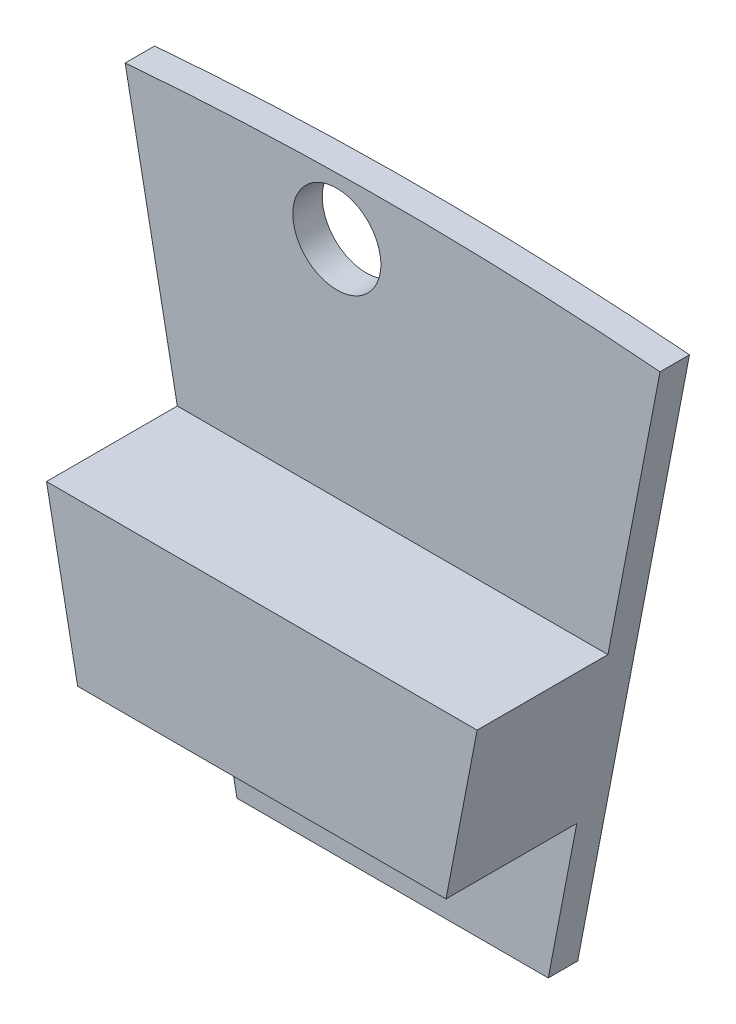
ISO-10303-21;
HEADER;
FILE_DESCRIPTION(('STEP AP214'),'2;1');
FILE_NAME('part.step','',(''),(''),'','','');
FILE_SCHEMA(('AUTOMOTIVE_DESIGN { 1 0 10303 214 1 1 1 1 }'));
ENDSEC;
DATA;
#1=APPLICATION_CONTEXT('core data for automotive mechanical design processes');
#2=APPLICATION_PROTOCOL_DEFINITION('international standard','automotive_design',2000,#1);
#3=PRODUCT_CONTEXT('',#1,'mechanical');
#4=PRODUCT('Part','Part','',(#3));
#5=PRODUCT_RELATED_PRODUCT_CATEGORY('part','',(#4));
#6=PRODUCT_DEFINITION_FORMATION('','',#4);
#7=PRODUCT_DEFINITION_CONTEXT('part definition',#1,'design');
#8=PRODUCT_DEFINITION('design','',#6,#7);
#9=PRODUCT_DEFINITION_SHAPE('','',#8);
#10=(LENGTH_UNIT() NAMED_UNIT(*) SI_UNIT(.MILLI.,.METRE.));
#11=(NAMED_UNIT(*) PLANE_ANGLE_UNIT() SI_UNIT($,.RADIAN.));
#12=(NAMED_UNIT(*) SI_UNIT($,.STERADIAN.) SOLID_ANGLE_UNIT());
#13=UNCERTAINTY_MEASURE_WITH_UNIT(LENGTH_MEASURE(1.E-05),#10,'distance_accuracy_value','');
#14=(GEOMETRIC_REPRESENTATION_CONTEXT(3) GLOBAL_UNCERTAINTY_ASSIGNED_CONTEXT((#13)) GLOBAL_UNIT_ASSIGNED_CONTEXT((#10,
#11,#12)) REPRESENTATION_CONTEXT('',''));
#15=CARTESIAN_POINT('',(0.,0.,0.));
#16=DIRECTION('',(0.,0.,1.));
#17=DIRECTION('',(1.,0.,0.));
#18=AXIS2_PLACEMENT_3D('',#15,#16,#17);
#19=CARTESIAN_POINT('',(-6.58395838801708,90.8766231600002,0.));
#20=DIRECTION('',(0.,0.,-0.999999999999994));
#21=DIRECTION('',(-1.,0.,0.));
#22=AXIS2_PLACEMENT_3D('',#19,#20,#21);
#23=PLANE('',#22);
#24=CARTESIAN_POINT('',(-1.70597272924437,97.7351122015374,0.));
#25=DIRECTION('',(0.,0.,0.999999999999994));
#26=DIRECTION('',(1.,0.,0.));
#27=AXIS2_PLACEMENT_3D('',#24,#25,#26);
#28=CIRCLE('',#27,1.34620000000001);
#29=CARTESIAN_POINT('',(-0.359772729244356,97.7351122015374,0.));
#30=VERTEX_POINT('',#29);
#31=EDGE_CURVE('E127',#30,#30,#28,.T.);
#32=ORIENTED_EDGE('',*,*,#31,.T.);
#33=EDGE_LOOP('',(#32));
#34=FACE_BOUND('',#33,.T.);
#35=DIRECTION('',(0.188943637083483,0.981987933737309,0.));
#36=VECTOR('',#35,1.);
#37=CARTESIAN_POINT('',(5.63213312557401,85.9297462120742,0.));
#38=LINE('',#37,#36);
#39=CARTESIAN_POINT('',(4.76056770713033,81.4,0.));
#40=VERTEX_POINT('',#39);
#41=CARTESIAN_POINT('',(8.17839595884315,99.1633190224108,0.));
#42=VERTEX_POINT('',#41);
#43=EDGE_CURVE('E192',#40,#42,#38,.T.);
#44=ORIENTED_EDGE('',*,*,#43,.F.);
#45=DIRECTION('',(-1.,0.,0.));
#46=VECTOR('',#45,1.);
#47=CARTESIAN_POINT('',(-4.76056770713023,81.4000000000001,0.));
#48=LINE('',#47,#46);
#49=CARTESIAN_POINT('',(-4.76056770713023,81.4000000000001,0.));
#50=VERTEX_POINT('',#49);
#51=EDGE_CURVE('E156',#40,#50,#48,.T.);
#52=ORIENTED_EDGE('',*,*,#51,.T.);
#53=DIRECTION('',(0.188943637083481,-0.981987933737309,0.));
#54=VECTOR('',#53,1.);
#55=CARTESIAN_POINT('',(-5.6321331255739,85.9297462120742,0.));
#56=LINE('',#55,#54);
#57=CARTESIAN_POINT('',(-8.17839595884303,99.1633190224107,0.));
#58=VERTEX_POINT('',#57);
#59=EDGE_CURVE('E185',#58,#50,#56,.T.);
#60=ORIENTED_EDGE('',*,*,#59,.F.);
#61=CARTESIAN_POINT('',(0.,0.,0.));
#62=DIRECTION('',(0.,0.,-0.999999999999994));
#63=DIRECTION('',(1.,0.,0.));
#64=AXIS2_PLACEMENT_3D('',#61,#62,#63);
#65=CIRCLE('',#64,99.5);
#66=EDGE_CURVE('E168',#58,#42,#65,.T.);
#67=ORIENTED_EDGE('',*,*,#66,.T.);
#68=EDGE_LOOP('',(#44,#52,#60,#67));
#69=FACE_BOUND('',#68,.T.);
#70=DIRECTION('',(-0.0174524064372812,0.999847695156393,0.));
#71=VECTOR('',#70,1.);
#72=CARTESIAN_POINT('',(-1.06918891596203,83.9942089693636,0.));
#73=LINE('',#72,#71);
#74=CARTESIAN_POINT('',(-1.05173385103382,82.9942089693636,0.));
#75=VERTEX_POINT('',#74);
#76=CARTESIAN_POINT('',(-1.06918891596203,83.9942089693636,0.));
#77=VERTEX_POINT('',#76);
#78=EDGE_CURVE('E140',#75,#77,#73,.T.);
#79=ORIENTED_EDGE('',*,*,#78,.T.);
#80=CARTESIAN_POINT('',(-1.46600346997723,83.9872825455589,0.));
#81=DIRECTION('',(0.,0.,0.999999999999994));
#82=DIRECTION('',(1.,0.,0.));
#83=AXIS2_PLACEMENT_3D('',#80,#81,#82);
#84=CIRCLE('',#83,0.396875);
#85=CARTESIAN_POINT('',(-1.86281802399245,83.9803561217539,0.));
#86=VERTEX_POINT('',#85);
#87=EDGE_CURVE('E49',#77,#86,#84,.T.);
#88=ORIENTED_EDGE('',*,*,#87,.T.);
#89=DIRECTION('',(0.0174524064372831,-0.999847695156393,0.));
#90=VECTOR('',#89,1.);
#91=CARTESIAN_POINT('',(-1.86281802399245,83.9803561217539,0.));
#92=LINE('',#91,#90);
#93=CARTESIAN_POINT('',(-1.84536295906416,82.980356121754,0.));
#94=VERTEX_POINT('',#93);
#95=EDGE_CURVE('E131',#86,#94,#92,.T.);
#96=ORIENTED_EDGE('',*,*,#95,.T.);
#97=CARTESIAN_POINT('',(-1.44854840504902,82.9872825455587,0.));
#98=DIRECTION('',(0.,0.,0.999999999999994));
#99=DIRECTION('',(-1.,0.,0.));
#100=AXIS2_PLACEMENT_3D('',#97,#98,#99);
#101=CIRCLE('',#100,0.396875);
#102=EDGE_CURVE('E137',#94,#75,#101,.T.);
#103=ORIENTED_EDGE('',*,*,#102,.T.);
#104=EDGE_LOOP('',(#79,#88,#96,#103));
#105=FACE_BOUND('',#104,.T.);
#106=ADVANCED_FACE('F34',(#34,#69,#105),#23,.T.);
#107=CARTESIAN_POINT('',(0.,0.,0.899999999999994));
#108=DIRECTION('',(0.,0.,-0.999999999999994));
#109=DIRECTION('',(-1.,0.,0.));
#110=AXIS2_PLACEMENT_3D('',#107,#108,#109);
#111=PLANE('',#110);
#112=DIRECTION('',(-0.188943637083483,-0.981987933737308,0.));
#113=VECTOR('',#112,1.);
#114=CARTESIAN_POINT('',(4.76056770713033,81.4,0.899999999999983));
#115=LINE('',#114,#113);
#116=CARTESIAN_POINT('',(5.63213312557401,85.9297462120742,0.900000000000001));
#117=VERTEX_POINT('',#116);
#118=CARTESIAN_POINT('',(4.76056770713033,81.4,0.899999999999983));
#119=VERTEX_POINT('',#118);
#120=EDGE_CURVE('E152',#117,#119,#115,.T.);
#121=ORIENTED_EDGE('',*,*,#120,.F.);
#122=DIRECTION('',(-1.,0.,0.));
#123=VECTOR('',#122,1.);
#124=CARTESIAN_POINT('',(-5.6321331255739,85.9297462120742,0.899999999999991));
#125=LINE('',#124,#123);
#126=CARTESIAN_POINT('',(-5.6321331255739,85.9297462120742,0.899999999999991));
#127=VERTEX_POINT('',#126);
#128=EDGE_CURVE('E214',#117,#127,#125,.T.);
#129=ORIENTED_EDGE('',*,*,#128,.T.);
#130=DIRECTION('',(-0.18894363708348,0.981987933737309,0.));
#131=VECTOR('',#130,1.);
#132=CARTESIAN_POINT('',(-5.6321331255739,85.9297462120742,0.899999999999991));
#133=LINE('',#132,#131);
#134=CARTESIAN_POINT('',(-4.76056770713023,81.4000000000001,0.899999999999991));
#135=VERTEX_POINT('',#134);
#136=EDGE_CURVE('E159',#135,#127,#133,.T.);
#137=ORIENTED_EDGE('',*,*,#136,.F.);
#138=DIRECTION('',(-1.,0.,0.));
#139=VECTOR('',#138,1.);
#140=CARTESIAN_POINT('',(-4.76056770713023,81.4000000000001,0.899999999999991));
#141=LINE('',#140,#139);
#142=EDGE_CURVE('E155',#119,#135,#141,.T.);
#143=ORIENTED_EDGE('',*,*,#142,.F.);
#144=EDGE_LOOP('',(#121,#129,#137,#143));
#145=FACE_BOUND('',#144,.T.);
#146=CARTESIAN_POINT('',(-1.46600346997723,83.9872825455589,0.899999999999991));
#147=DIRECTION('',(0.,0.,-0.999999999999994));
#148=DIRECTION('',(-1.,0.,0.));
#149=AXIS2_PLACEMENT_3D('',#146,#147,#148);
#150=CIRCLE('',#149,0.396875);
#151=CARTESIAN_POINT('',(-1.06918891596203,83.9942089693636,0.899999999999998));
#152=VERTEX_POINT('',#151);
#153=CARTESIAN_POINT('',(-1.86281802399245,83.9803561217539,0.89999999999999));
#154=VERTEX_POINT('',#153);
#155=EDGE_CURVE('E11',#152,#154,#150,.F.);
#156=ORIENTED_EDGE('',*,*,#155,.F.);
#157=DIRECTION('',(-0.0174524064372815,0.999847695156393,0.));
#158=VECTOR('',#157,1.);
#159=CARTESIAN_POINT('',(0.39681455401509,0.00692642380479496,0.899999999999994));
#160=LINE('',#159,#158);
#161=CARTESIAN_POINT('',(-1.05173385103378,82.9942089693636,0.899999999999991));
#162=VERTEX_POINT('',#161);
#163=EDGE_CURVE('E216',#162,#152,#160,.T.);
#164=ORIENTED_EDGE('',*,*,#163,.F.);
#165=CARTESIAN_POINT('',(-1.44854840504902,82.9872825455587,0.899999999999991));
#166=DIRECTION('',(0.,0.,-0.999999999999994));
#167=DIRECTION('',(-1.,0.,0.));
#168=AXIS2_PLACEMENT_3D('',#165,#166,#167);
#169=CIRCLE('',#168,0.396875);
#170=CARTESIAN_POINT('',(-1.84536295906416,82.980356121754,0.899999999999991));
#171=VERTEX_POINT('',#170);
#172=EDGE_CURVE('E220',#171,#162,#169,.F.);
#173=ORIENTED_EDGE('',*,*,#172,.F.);
#174=DIRECTION('',(0.0174524064372831,-0.999847695156393,0.));
#175=VECTOR('',#174,1.);
#176=CARTESIAN_POINT('',(-0.396814554015166,-0.00692642380479685,0.899999999999994));
#177=LINE('',#176,#175);
#178=EDGE_CURVE('E42',#154,#171,#177,.T.);
#179=ORIENTED_EDGE('',*,*,#178,.F.);
#180=EDGE_LOOP('',(#156,#164,#173,#179));
#181=FACE_BOUND('',#180,.T.);
#182=ADVANCED_FACE('F226',(#145,#181),#111,.F.);
#183=CARTESIAN_POINT('',(0.,0.,0.899999999999994));
#184=DIRECTION('',(0.,0.,-0.999999999999994));
#185=DIRECTION('',(-1.,0.,0.));
#186=AXIS2_PLACEMENT_3D('',#183,#184,#185);
#187=PLANE('',#186);
#188=DIRECTION('',(-0.188943637083481,0.981987933737309,0.));
#189=VECTOR('',#188,1.);
#190=CARTESIAN_POINT('',(-8.17839595884303,99.1633190224107,0.899999999999994));
#191=LINE('',#190,#189);
#192=CARTESIAN_POINT('',(-6.58395838801708,90.8766231600002,0.899999999999998));
#193=VERTEX_POINT('',#192);
#194=CARTESIAN_POINT('',(-8.17839595884303,99.1633190224107,0.899999999999994));
#195=VERTEX_POINT('',#194);
#196=EDGE_CURVE('E171',#193,#195,#191,.T.);
#197=ORIENTED_EDGE('',*,*,#196,.F.);
#198=DIRECTION('',(1.,0.,0.));
#199=VECTOR('',#198,1.);
#200=CARTESIAN_POINT('',(-6.58395838801708,90.8766231600002,0.899999999999998));
#201=LINE('',#200,#199);
#202=CARTESIAN_POINT('',(6.5839583880172,90.8766231600001,0.900000000000001));
#203=VERTEX_POINT('',#202);
#204=EDGE_CURVE('E211',#193,#203,#201,.T.);
#205=ORIENTED_EDGE('',*,*,#204,.T.);
#206=DIRECTION('',(-0.188943637083483,-0.981987933737308,0.));
#207=VECTOR('',#206,1.);
#208=CARTESIAN_POINT('',(8.17839595884315,99.1633190224108,0.900000000000007));
#209=LINE('',#208,#207);
#210=CARTESIAN_POINT('',(8.17839595884315,99.1633190224108,0.900000000000007));
#211=VERTEX_POINT('',#210);
#212=EDGE_CURVE('E176',#211,#203,#209,.T.);
#213=ORIENTED_EDGE('',*,*,#212,.F.);
#214=CARTESIAN_POINT('',(0.,0.,0.899999999999994));
#215=DIRECTION('',(0.,0.,-0.999999999999994));
#216=DIRECTION('',(1.,0.,0.));
#217=AXIS2_PLACEMENT_3D('',#214,#215,#216);
#218=CIRCLE('',#217,99.5);
#219=EDGE_CURVE('E173',#195,#211,#218,.T.);
#220=ORIENTED_EDGE('',*,*,#219,.F.);
#221=EDGE_LOOP('',(#197,#205,#213,#220));
#222=FACE_BOUND('',#221,.T.);
#223=CARTESIAN_POINT('',(-1.70597272924437,97.7351122015374,0.900000000000001));
#224=DIRECTION('',(0.,0.,-0.999999999999994));
#225=DIRECTION('',(-1.,0.,0.));
#226=AXIS2_PLACEMENT_3D('',#223,#224,#225);
#227=CIRCLE('',#226,1.34620000000001);
#228=CARTESIAN_POINT('',(-3.05217272924438,97.7351122015374,0.900000000000001));
#229=VERTEX_POINT('',#228);
#230=EDGE_CURVE('E151',#229,#229,#227,.F.);
#231=ORIENTED_EDGE('',*,*,#230,.F.);
#232=EDGE_LOOP('',(#231));
#233=FACE_BOUND('',#232,.T.);
#234=ADVANCED_FACE('F240',(#222,#233),#187,.F.);
#235=CARTESIAN_POINT('',(-5.6321331255739,85.9297462120742,4.89999999999995));
#236=DIRECTION('',(0.,1.,0.));
#237=DIRECTION('',(0.,0.,0.999999999999994));
#238=AXIS2_PLACEMENT_3D('',#235,#236,#237);
#239=PLANE('',#238);
#240=ORIENTED_EDGE('',*,*,#128,.F.);
#241=DIRECTION('',(0.,0.,-0.999999999999994));
#242=VECTOR('',#241,1.);
#243=CARTESIAN_POINT('',(5.63213312557401,85.9297462120742,4.89999999999998));
#244=LINE('',#243,#242);
#245=CARTESIAN_POINT('',(5.63213312557401,85.9297462120742,4.89999999999998));
#246=VERTEX_POINT('',#245);
#247=EDGE_CURVE('E205',#246,#117,#244,.T.);
#248=ORIENTED_EDGE('',*,*,#247,.F.);
#249=DIRECTION('',(1.,0.,0.));
#250=VECTOR('',#249,1.);
#251=CARTESIAN_POINT('',(-5.6321331255739,85.9297462120742,4.89999999999995));
#252=LINE('',#251,#250);
#253=CARTESIAN_POINT('',(-5.6321331255739,85.9297462120742,4.89999999999995));
#254=VERTEX_POINT('',#253);
#255=EDGE_CURVE('E191',#254,#246,#252,.T.);
#256=ORIENTED_EDGE('',*,*,#255,.F.);
#257=DIRECTION('',(0.,0.,-0.999999999999994));
#258=VECTOR('',#257,1.);
#259=CARTESIAN_POINT('',(-5.6321331255739,85.9297462120742,4.89999999999995));
#260=LINE('',#259,#258);
#261=EDGE_CURVE('E208',#254,#127,#260,.T.);
#262=ORIENTED_EDGE('',*,*,#261,.T.);
#263=EDGE_LOOP('',(#240,#248,#256,#262));
#264=FACE_BOUND('',#263,.T.);
#265=ADVANCED_FACE('F251',(#264),#239,.F.);
#266=CARTESIAN_POINT('',(-6.58395838801708,90.8766231600002,4.89999999999996));
#267=DIRECTION('',(0.,-1.,0.));
#268=DIRECTION('',(0.,0.,-0.999999999999994));
#269=AXIS2_PLACEMENT_3D('',#266,#267,#268);
#270=PLANE('',#269);
#271=ORIENTED_EDGE('',*,*,#204,.F.);
#272=DIRECTION('',(0.,0.,-0.999999999999994));
#273=VECTOR('',#272,1.);
#274=CARTESIAN_POINT('',(-6.58395838801708,90.8766231600002,4.89999999999996));
#275=LINE('',#274,#273);
#276=CARTESIAN_POINT('',(-6.58395838801708,90.8766231600002,4.89999999999996));
#277=VERTEX_POINT('',#276);
#278=EDGE_CURVE('E198',#277,#193,#275,.T.);
#279=ORIENTED_EDGE('',*,*,#278,.F.);
#280=DIRECTION('',(-1.,0.,0.));
#281=VECTOR('',#280,1.);
#282=CARTESIAN_POINT('',(-6.58395838801708,90.8766231600002,4.89999999999996));
#283=LINE('',#282,#281);
#284=CARTESIAN_POINT('',(6.5839583880172,90.8766231600001,4.89999999999996));
#285=VERTEX_POINT('',#284);
#286=EDGE_CURVE('E196',#285,#277,#283,.T.);
#287=ORIENTED_EDGE('',*,*,#286,.F.);
#288=DIRECTION('',(0.,0.,-0.999999999999994));
#289=VECTOR('',#288,1.);
#290=CARTESIAN_POINT('',(6.5839583880172,90.8766231600001,4.89999999999996));
#291=LINE('',#290,#289);
#292=EDGE_CURVE('E203',#285,#203,#291,.T.);
#293=ORIENTED_EDGE('',*,*,#292,.T.);
#294=EDGE_LOOP('',(#271,#279,#287,#293));
#295=FACE_BOUND('',#294,.T.);
#296=ADVANCED_FACE('F248',(#295),#270,.F.);
#297=CARTESIAN_POINT('',(-5.6321331255739,85.9297462120742,4.89999999999995));
#298=DIRECTION('',(0.981987933737309,0.188943637083483,0.));
#299=DIRECTION('',(-0.188943637083482,0.981987933737308,0.));
#300=AXIS2_PLACEMENT_3D('',#297,#298,#299);
#301=PLANE('',#300);
#302=ORIENTED_EDGE('',*,*,#59,.T.);
#303=DIRECTION('',(0.,0.,-0.999999999999994));
#304=VECTOR('',#303,1.);
#305=CARTESIAN_POINT('',(-4.76056770713023,81.4000000000001,0.899999999999991));
#306=LINE('',#305,#304);
#307=EDGE_CURVE('E165',#135,#50,#306,.T.);
#308=ORIENTED_EDGE('',*,*,#307,.F.);
#309=ORIENTED_EDGE('',*,*,#136,.T.);
#310=ORIENTED_EDGE('',*,*,#261,.F.);
#311=DIRECTION('',(0.188943637083481,-0.981987933737309,0.));
#312=VECTOR('',#311,1.);
#313=CARTESIAN_POINT('',(-5.6321331255739,85.9297462120742,4.89999999999995));
#314=LINE('',#313,#312);
#315=EDGE_CURVE('E188',#277,#254,#314,.T.);
#316=ORIENTED_EDGE('',*,*,#315,.F.);
#317=ORIENTED_EDGE('',*,*,#278,.T.);
#318=ORIENTED_EDGE('',*,*,#196,.T.);
#319=DIRECTION('',(0.,0.,-0.999999999999994));
#320=VECTOR('',#319,1.);
#321=CARTESIAN_POINT('',(-8.17839595884303,99.1633190224107,0.899999999999994));
#322=LINE('',#321,#320);
#323=EDGE_CURVE('E179',#195,#58,#322,.T.);
#324=ORIENTED_EDGE('',*,*,#323,.T.);
#325=EDGE_LOOP('',(#302,#308,#309,#310,#316,#317,#318,#324));
#326=FACE_BOUND('',#325,.T.);
#327=ADVANCED_FACE('F36',(#326),#301,.F.);
#328=CARTESIAN_POINT('',(5.63213312557401,85.9297462120742,4.89999999999998));
#329=DIRECTION('',(-0.981987933737309,0.188943637083481,0.));
#330=DIRECTION('',(-0.188943637083483,-0.981987933737308,0.));
#331=AXIS2_PLACEMENT_3D('',#328,#329,#330);
#332=PLANE('',#331);
#333=ORIENTED_EDGE('',*,*,#43,.T.);
#334=DIRECTION('',(0.,0.,-0.999999999999994));
#335=VECTOR('',#334,1.);
#336=CARTESIAN_POINT('',(8.17839595884315,99.1633190224108,0.900000000000007));
#337=LINE('',#336,#335);
#338=EDGE_CURVE('E182',#211,#42,#337,.T.);
#339=ORIENTED_EDGE('',*,*,#338,.F.);
#340=ORIENTED_EDGE('',*,*,#212,.T.);
#341=ORIENTED_EDGE('',*,*,#292,.F.);
#342=DIRECTION('',(0.188943637083483,0.981987933737309,0.));
#343=VECTOR('',#342,1.);
#344=CARTESIAN_POINT('',(5.63213312557401,85.9297462120742,4.89999999999998));
#345=LINE('',#344,#343);
#346=EDGE_CURVE('E194',#246,#285,#345,.T.);
#347=ORIENTED_EDGE('',*,*,#346,.F.);
#348=ORIENTED_EDGE('',*,*,#247,.T.);
#349=ORIENTED_EDGE('',*,*,#120,.T.);
#350=DIRECTION('',(0.,0.,-0.999999999999994));
#351=VECTOR('',#350,1.);
#352=CARTESIAN_POINT('',(4.76056770713033,81.4,0.899999999999983));
#353=LINE('',#352,#351);
#354=EDGE_CURVE('E162',#119,#40,#353,.T.);
#355=ORIENTED_EDGE('',*,*,#354,.T.);
#356=EDGE_LOOP('',(#333,#339,#340,#341,#347,#348,#349,#355));
#357=FACE_BOUND('',#356,.T.);
#358=ADVANCED_FACE('F253',(#357),#332,.F.);
#359=CARTESIAN_POINT('',(-6.58395838801708,90.8766231600002,4.89999999999996));
#360=DIRECTION('',(0.,0.,-0.999999999999994));
#361=DIRECTION('',(-1.,0.,0.));
#362=AXIS2_PLACEMENT_3D('',#359,#360,#361);
#363=PLANE('',#362);
#364=ORIENTED_EDGE('',*,*,#315,.T.);
#365=ORIENTED_EDGE('',*,*,#255,.T.);
#366=ORIENTED_EDGE('',*,*,#346,.T.);
#367=ORIENTED_EDGE('',*,*,#286,.T.);
#368=EDGE_LOOP('',(#364,#365,#366,#367));
#369=FACE_BOUND('',#368,.T.);
#370=ADVANCED_FACE('F246',(#369),#363,.F.);
#371=CARTESIAN_POINT('',(0.,0.,0.899999999999994));
#372=DIRECTION('',(0.,0.,-0.999999999999994));
#373=DIRECTION('',(-1.,0.,0.));
#374=AXIS2_PLACEMENT_3D('',#371,#372,#373);
#375=CYLINDRICAL_SURFACE('',#374,99.5);
#376=ORIENTED_EDGE('',*,*,#66,.F.);
#377=ORIENTED_EDGE('',*,*,#323,.F.);
#378=ORIENTED_EDGE('',*,*,#219,.T.);
#379=ORIENTED_EDGE('',*,*,#338,.T.);
#380=EDGE_LOOP('',(#376,#377,#378,#379));
#381=FACE_BOUND('',#380,.T.);
#382=ADVANCED_FACE('F280',(#381),#375,.T.);
#383=CARTESIAN_POINT('',(-4.76056770713023,81.4000000000001,0.899999999999991));
#384=DIRECTION('',(0.,-1.,0.));
#385=DIRECTION('',(0.,0.,-0.999999999999994));
#386=AXIS2_PLACEMENT_3D('',#383,#384,#385);
#387=PLANE('',#386);
#388=ORIENTED_EDGE('',*,*,#51,.F.);
#389=ORIENTED_EDGE('',*,*,#354,.F.);
#390=ORIENTED_EDGE('',*,*,#142,.T.);
#391=ORIENTED_EDGE('',*,*,#307,.T.);
#392=EDGE_LOOP('',(#388,#389,#390,#391));
#393=FACE_BOUND('',#392,.T.);
#394=ADVANCED_FACE('F277',(#393),#387,.T.);
#395=CARTESIAN_POINT('',(-1.70597272924437,97.7351122015374,4.89999999999996));
#396=DIRECTION('',(0.,0.,-0.999999999999994));
#397=DIRECTION('',(-1.,0.,0.));
#398=AXIS2_PLACEMENT_3D('',#395,#396,#397);
#399=CYLINDRICAL_SURFACE('',#398,1.34620000000001);
#400=ORIENTED_EDGE('',*,*,#31,.F.);
#401=EDGE_LOOP('',(#400));
#402=FACE_BOUND('',#401,.T.);
#403=ORIENTED_EDGE('',*,*,#230,.T.);
#404=EDGE_LOOP('',(#403));
#405=FACE_BOUND('',#404,.T.);
#406=ADVANCED_FACE('F288',(#402,#405),#399,.F.);
#407=CARTESIAN_POINT('',(-1.46600346997723,83.9872825455589,4.89999999999997));
#408=DIRECTION('',(0.,0.,-0.999999999999994));
#409=DIRECTION('',(-1.,0.,0.));
#410=AXIS2_PLACEMENT_3D('',#407,#408,#409);
#411=CYLINDRICAL_SURFACE('',#410,0.396875);
#412=ORIENTED_EDGE('',*,*,#155,.T.);
#413=DIRECTION('',(0.,0.,-0.999999999999994));
#414=VECTOR('',#413,1.);
#415=CARTESIAN_POINT('',(-1.86281802399245,83.9803561217539,4.89999999999997));
#416=LINE('',#415,#414);
#417=EDGE_CURVE('E121',#154,#86,#416,.T.);
#418=ORIENTED_EDGE('',*,*,#417,.T.);
#419=ORIENTED_EDGE('',*,*,#87,.F.);
#420=DIRECTION('',(0.,0.,-0.999999999999994));
#421=VECTOR('',#420,1.);
#422=CARTESIAN_POINT('',(-1.06918891596203,83.9942089693636,4.89999999999997));
#423=LINE('',#422,#421);
#424=EDGE_CURVE('E145',#152,#77,#423,.T.);
#425=ORIENTED_EDGE('',*,*,#424,.F.);
#426=EDGE_LOOP('',(#412,#418,#419,#425));
#427=FACE_BOUND('',#426,.T.);
#428=ADVANCED_FACE('F123',(#427),#411,.F.);
#429=CARTESIAN_POINT('',(-1.86281802399245,83.9803561217539,4.89999999999997));
#430=DIRECTION('',(0.999847695156393,0.017452406437285,0.));
#431=DIRECTION('',(-0.0174524064372831,0.999847695156393,0.));
#432=AXIS2_PLACEMENT_3D('',#429,#430,#431);
#433=PLANE('',#432);
#434=ORIENTED_EDGE('',*,*,#178,.T.);
#435=DIRECTION('',(0.,0.,-0.999999999999994));
#436=VECTOR('',#435,1.);
#437=CARTESIAN_POINT('',(-1.84536295906416,82.980356121754,4.89999999999997));
#438=LINE('',#437,#436);
#439=EDGE_CURVE('E128',#171,#94,#438,.T.);
#440=ORIENTED_EDGE('',*,*,#439,.T.);
#441=ORIENTED_EDGE('',*,*,#95,.F.);
#442=ORIENTED_EDGE('',*,*,#417,.F.);
#443=EDGE_LOOP('',(#434,#440,#441,#442));
#444=FACE_BOUND('',#443,.T.);
#445=ADVANCED_FACE('F132',(#444),#433,.T.);
#446=CARTESIAN_POINT('',(-1.44854840504902,82.9872825455587,4.89999999999997));
#447=DIRECTION('',(0.,0.,-0.999999999999994));
#448=DIRECTION('',(-1.,0.,0.));
#449=AXIS2_PLACEMENT_3D('',#446,#447,#448);
#450=CYLINDRICAL_SURFACE('',#449,0.396875);
#451=ORIENTED_EDGE('',*,*,#172,.T.);
#452=DIRECTION('',(0.,0.,-0.999999999999994));
#453=VECTOR('',#452,1.);
#454=CARTESIAN_POINT('',(-1.05173385103382,82.9942089693636,4.89999999999997));
#455=LINE('',#454,#453);
#456=EDGE_CURVE('E57',#162,#75,#455,.T.);
#457=ORIENTED_EDGE('',*,*,#456,.T.);
#458=ORIENTED_EDGE('',*,*,#102,.F.);
#459=ORIENTED_EDGE('',*,*,#439,.F.);
#460=EDGE_LOOP('',(#451,#457,#458,#459));
#461=FACE_BOUND('',#460,.T.);
#462=ADVANCED_FACE('F224',(#461),#450,.F.);
#463=CARTESIAN_POINT('',(-1.06918891596203,83.9942089693636,4.89999999999997));
#464=DIRECTION('',(-0.999847695156393,-0.017452406437283,0.));
#465=DIRECTION('',(0.0174524064372815,-0.999847695156393,0.));
#466=AXIS2_PLACEMENT_3D('',#463,#464,#465);
#467=PLANE('',#466);
#468=ORIENTED_EDGE('',*,*,#163,.T.);
#469=ORIENTED_EDGE('',*,*,#424,.T.);
#470=ORIENTED_EDGE('',*,*,#78,.F.);
#471=ORIENTED_EDGE('',*,*,#456,.F.);
#472=EDGE_LOOP('',(#468,#469,#470,#471));
#473=FACE_BOUND('',#472,.T.);
#474=ADVANCED_FACE('F227',(#473),#467,.T.);
#475=CLOSED_SHELL('',(#106,#182,#234,#265,#296,#327,#358,#370,#382,#394,#406,#428,#445,#462,#474));
#476=MANIFOLD_SOLID_BREP('B2',#475);
#477=ADVANCED_BREP_SHAPE_REPRESENTATION('',(#18,#476),#14);
#478=SHAPE_DEFINITION_REPRESENTATION(#9,#477);
ENDSEC;
END-ISO-10303-21;
